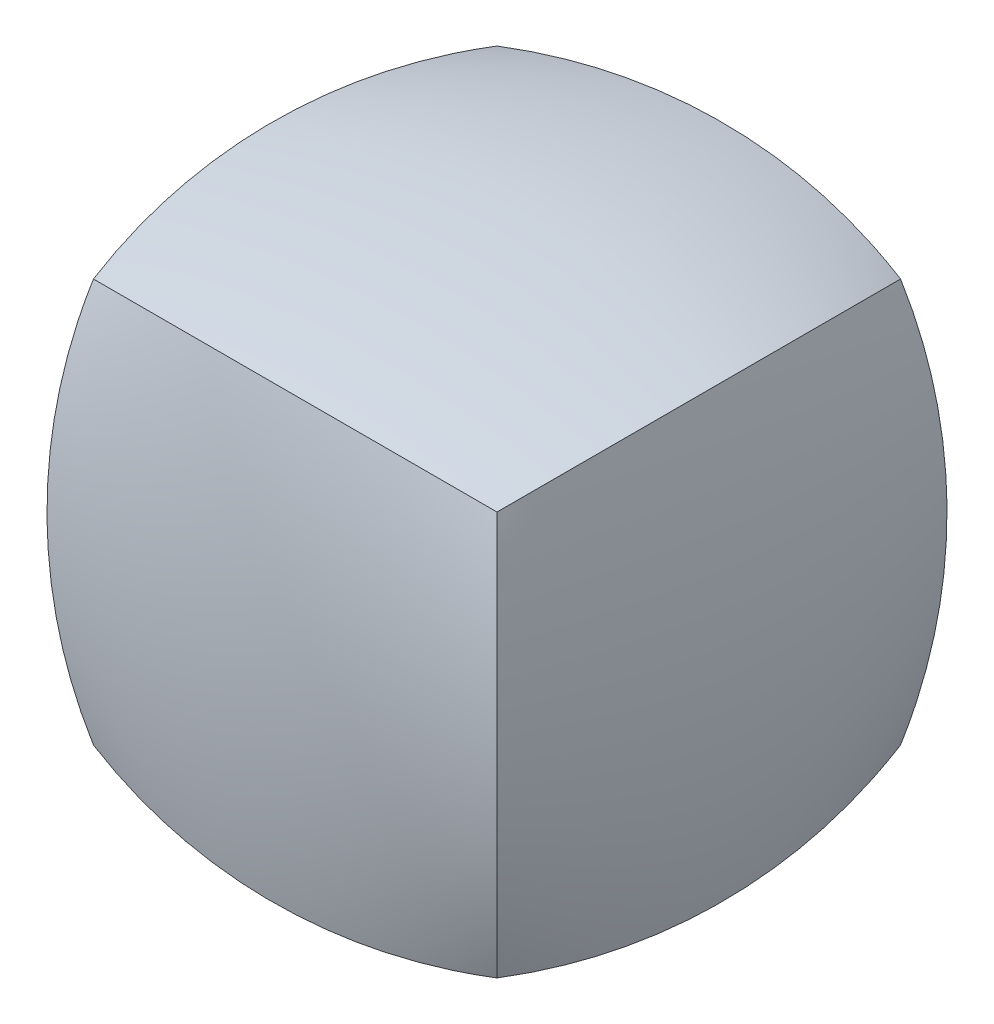
ISO-10303-21;
HEADER;
FILE_DESCRIPTION(('STEP AP214'),'2;1');
FILE_NAME('part.step','',(''),(''),'','','');
FILE_SCHEMA(('AUTOMOTIVE_DESIGN { 1 0 10303 214 1 1 1 1 }'));
ENDSEC;
DATA;
#1=APPLICATION_CONTEXT('core data for automotive mechanical design processes');
#2=APPLICATION_PROTOCOL_DEFINITION('international standard','automotive_design',2000,#1);
#3=PRODUCT_CONTEXT('',#1,'mechanical');
#4=PRODUCT('Part','Part','',(#3));
#5=PRODUCT_RELATED_PRODUCT_CATEGORY('part','',(#4));
#6=PRODUCT_DEFINITION_FORMATION('','',#4);
#7=PRODUCT_DEFINITION_CONTEXT('part definition',#1,'design');
#8=PRODUCT_DEFINITION('design','',#6,#7);
#9=PRODUCT_DEFINITION_SHAPE('','',#8);
#10=(LENGTH_UNIT() NAMED_UNIT(*) SI_UNIT(.MILLI.,.METRE.));
#11=(NAMED_UNIT(*) PLANE_ANGLE_UNIT() SI_UNIT($,.RADIAN.));
#12=(NAMED_UNIT(*) SI_UNIT($,.STERADIAN.) SOLID_ANGLE_UNIT());
#13=UNCERTAINTY_MEASURE_WITH_UNIT(LENGTH_MEASURE(1.E-05),#10,'distance_accuracy_value','');
#14=(GEOMETRIC_REPRESENTATION_CONTEXT(3) GLOBAL_UNCERTAINTY_ASSIGNED_CONTEXT((#13)) GLOBAL_UNIT_ASSIGNED_CONTEXT((#10,
#11,#12)) REPRESENTATION_CONTEXT('',''));
#15=CARTESIAN_POINT('',(0.,0.,0.));
#16=DIRECTION('',(0.,0.,1.));
#17=DIRECTION('',(1.,0.,0.));
#18=AXIS2_PLACEMENT_3D('',#15,#16,#17);
#19=CARTESIAN_POINT('',(-12.7,-12.7,12.7));
#20=CARTESIAN_POINT('',(-13.183216377052,-13.1832163770521,10.6573922002457));
#21=CARTESIAN_POINT('',(-13.9160332738068,-13.9160332738068,6.46166299538645));
#22=CARTESIAN_POINT('',(-14.2855769974257,-14.2855769974258,0.));
#23=CARTESIAN_POINT('',(-13.9160332738068,-13.9160332738068,-6.46166299538644));
#24=CARTESIAN_POINT('',(-13.183216377052,-13.1832163770521,-10.6573922002457));
#25=CARTESIAN_POINT('',(-12.7,-12.7,-12.7));
#26=CARTESIAN_POINT('',(-13.183216377052,-10.6573922002457,13.1832163770521));
#27=CARTESIAN_POINT('',(-13.6664327541041,-11.0520189081716,11.0520189081716));
#28=CARTESIAN_POINT('',(-14.3992496508588,-11.6504860405213,6.69119077448619));
#29=CARTESIAN_POINT('',(-14.7687933744778,-11.9522800814768,0.));
#30=CARTESIAN_POINT('',(-14.3992496508588,-11.6504860405213,-6.69119077448617));
#31=CARTESIAN_POINT('',(-13.6664327541041,-11.0520189081716,-11.0520189081716));
#32=CARTESIAN_POINT('',(-13.183216377052,-10.6573922002458,-13.1832163770521));
#33=CARTESIAN_POINT('',(-13.9160332738068,-6.46166299538648,13.9160332738068));
#34=CARTESIAN_POINT('',(-14.3992496508588,-6.69119077448622,11.6504860405213));
#35=CARTESIAN_POINT('',(-15.1320665476136,-7.03927880044471,7.03927880044468));
#36=CARTESIAN_POINT('',(-15.5016102712325,-7.21481206916371,0.));
#37=CARTESIAN_POINT('',(-15.1320665476136,-7.03927880044471,-7.03927880044467));
#38=CARTESIAN_POINT('',(-14.3992496508588,-6.69119077448622,-11.6504860405213));
#39=CARTESIAN_POINT('',(-13.9160332738068,-6.46166299538648,-13.9160332738068));
#40=CARTESIAN_POINT('',(-14.2855769974257,0.,14.2855769974258));
#41=CARTESIAN_POINT('',(-14.7687933744778,0.,11.9522800814768));
#42=CARTESIAN_POINT('',(-15.5016102712325,0.,7.21481206916369));
#43=CARTESIAN_POINT('',(-15.8711539948515,0.,0.));
#44=CARTESIAN_POINT('',(-15.5016102712325,0.,-7.21481206916368));
#45=CARTESIAN_POINT('',(-14.7687933744778,0.,-11.9522800814768));
#46=CARTESIAN_POINT('',(-14.2855769974258,0.,-14.2855769974258));
#47=CARTESIAN_POINT('',(-13.9160332738068,6.46166299538643,13.9160332738068));
#48=CARTESIAN_POINT('',(-14.3992496508589,6.69119077448615,11.6504860405213));
#49=CARTESIAN_POINT('',(-15.1320665476136,7.03927880044464,7.03927880044467));
#50=CARTESIAN_POINT('',(-15.5016102712325,7.21481206916367,0.));
#51=CARTESIAN_POINT('',(-15.1320665476136,7.03927880044462,-7.03927880044468));
#52=CARTESIAN_POINT('',(-14.3992496508589,6.69119077448615,-11.6504860405213));
#53=CARTESIAN_POINT('',(-13.9160332738068,6.46166299538642,-13.9160332738068));
#54=CARTESIAN_POINT('',(-13.1832163770521,10.6573922002457,13.1832163770521));
#55=CARTESIAN_POINT('',(-13.6664327541042,11.0520189081716,11.0520189081716));
#56=CARTESIAN_POINT('',(-14.3992496508589,11.6504860405212,6.69119077448619));
#57=CARTESIAN_POINT('',(-14.7687933744778,11.9522800814768,0.));
#58=CARTESIAN_POINT('',(-14.3992496508589,11.6504860405212,-6.69119077448619));
#59=CARTESIAN_POINT('',(-13.6664327541042,11.0520189081716,-11.0520189081716));
#60=CARTESIAN_POINT('',(-13.1832163770521,10.6573922002457,-13.1832163770521));
#61=CARTESIAN_POINT('',(-12.7,12.7,12.7));
#62=CARTESIAN_POINT('',(-13.1832163770521,13.183216377052,10.6573922002457));
#63=CARTESIAN_POINT('',(-13.9160332738068,13.9160332738068,6.46166299538645));
#64=CARTESIAN_POINT('',(-14.2855769974258,14.2855769974257,0.));
#65=CARTESIAN_POINT('',(-13.9160332738068,13.9160332738067,-6.46166299538645));
#66=CARTESIAN_POINT('',(-13.1832163770521,13.183216377052,-10.6573922002457));
#67=CARTESIAN_POINT('',(-12.7,12.7,-12.7));
#68=B_SPLINE_SURFACE_WITH_KNOTS('',3,3,((#19,#20,#21,#22,#23,#24,#25),(#26,#27,#28,#29,#30,#31,
#32),(#33,#34,#35,#36,#37,#38,#39),(#40,#41,#42,#43,#44,#45,#46),(#47,#48,#49,#50,#51,#52,#53),
(#54,#55,#56,#57,#58,#59,#60),(#61,#62,#63,#64,#65,#66,#67)),.UNSPECIFIED.,.F.,.F.,.F.,(4,1,1,1,
4),(4,1,1,1,4),(0.,0.25,0.5,0.75,1.),(0.,0.25,0.5,0.75,1.),.UNSPECIFIED.);
#69=CARTESIAN_POINT('',(-12.7,-12.7,12.7));
#70=CARTESIAN_POINT('',(-13.183216377052,-10.6573922002457,13.1832163770521));
#71=CARTESIAN_POINT('',(-13.9160332738068,-6.46166299538648,13.9160332738068));
#72=CARTESIAN_POINT('',(-14.2855769974257,0.,14.2855769974258));
#73=CARTESIAN_POINT('',(-13.9160332738068,6.46166299538643,13.9160332738068));
#74=CARTESIAN_POINT('',(-13.1832163770521,10.6573922002457,13.1832163770521));
#75=CARTESIAN_POINT('',(-12.7,12.7,12.7));
#76=B_SPLINE_CURVE_WITH_KNOTS('',3,(#69,#70,#71,#72,#73,#74,#75),.UNSPECIFIED.,.F.,.F.,(4,1,1,1,
4),(0.,0.25,0.5,0.75,1.),.UNSPECIFIED.);
#77=CARTESIAN_POINT('',(-12.7,-12.7,12.7));
#78=VERTEX_POINT('',#77);
#79=CARTESIAN_POINT('',(-12.7,12.7,12.7));
#80=VERTEX_POINT('',#79);
#81=EDGE_CURVE('E195',#78,#80,#76,.T.);
#82=CARTESIAN_POINT('',(-12.7,12.7,12.7));
#83=CARTESIAN_POINT('',(-13.1832163770521,13.183216377052,10.6573922002457));
#84=CARTESIAN_POINT('',(-13.9160332738068,13.9160332738068,6.46166299538645));
#85=CARTESIAN_POINT('',(-14.2855769974258,14.2855769974257,0.));
#86=CARTESIAN_POINT('',(-13.9160332738068,13.9160332738067,-6.46166299538645));
#87=CARTESIAN_POINT('',(-13.1832163770521,13.183216377052,-10.6573922002457));
#88=CARTESIAN_POINT('',(-12.7,12.7,-12.7));
#89=B_SPLINE_CURVE_WITH_KNOTS('',3,(#82,#83,#84,#85,#86,#87,#88),.UNSPECIFIED.,.F.,.F.,(4,1,1,1,
4),(0.,0.25,0.5,0.75,1.),.UNSPECIFIED.);
#90=CARTESIAN_POINT('',(-12.7,12.7,-12.7));
#91=VERTEX_POINT('',#90);
#92=EDGE_CURVE('E293',#80,#91,#89,.T.);
#93=CARTESIAN_POINT('',(-12.7,-12.7,-12.7));
#94=CARTESIAN_POINT('',(-13.183216377052,-10.6573922002458,-13.1832163770521));
#95=CARTESIAN_POINT('',(-13.9160332738068,-6.46166299538648,-13.9160332738068));
#96=CARTESIAN_POINT('',(-14.2855769974258,0.,-14.2855769974258));
#97=CARTESIAN_POINT('',(-13.9160332738068,6.46166299538642,-13.9160332738068));
#98=CARTESIAN_POINT('',(-13.1832163770521,10.6573922002457,-13.1832163770521));
#99=CARTESIAN_POINT('',(-12.7,12.7,-12.7));
#100=B_SPLINE_CURVE_WITH_KNOTS('',3,(#93,#94,#95,#96,#97,#98,#99),.UNSPECIFIED.,.F.,.F.,(4,1,1,
1,4),(0.,0.25,0.5,0.75,1.),.UNSPECIFIED.);
#101=CARTESIAN_POINT('',(-12.7,-12.7,-12.7));
#102=VERTEX_POINT('',#101);
#103=EDGE_CURVE('E243',#91,#102,#100,.F.);
#104=CARTESIAN_POINT('',(-12.7,-12.7,12.7));
#105=CARTESIAN_POINT('',(-13.183216377052,-13.1832163770521,10.6573922002457));
#106=CARTESIAN_POINT('',(-13.9160332738068,-13.9160332738068,6.46166299538645));
#107=CARTESIAN_POINT('',(-14.2855769974257,-14.2855769974258,0.));
#108=CARTESIAN_POINT('',(-13.9160332738068,-13.9160332738068,-6.46166299538644));
#109=CARTESIAN_POINT('',(-13.183216377052,-13.1832163770521,-10.6573922002457));
#110=CARTESIAN_POINT('',(-12.7,-12.7,-12.7));
#111=B_SPLINE_CURVE_WITH_KNOTS('',3,(#104,#105,#106,#107,#108,#109,#110),.UNSPECIFIED.,.F.,.F.,
(4,1,1,1,4),(0.,0.25,0.5,0.75,1.),.UNSPECIFIED.);
#112=EDGE_CURVE('E242',#102,#78,#111,.F.);
#113=ORIENTED_EDGE('',*,*,#81,.T.);
#114=ORIENTED_EDGE('',*,*,#92,.T.);
#115=ORIENTED_EDGE('',*,*,#103,.T.);
#116=ORIENTED_EDGE('',*,*,#112,.T.);
#117=EDGE_LOOP('',(#113,#114,#115,#116));
#118=FACE_BOUND('',#117,.T.);
#119=ADVANCED_FACE('F190',(#118),#68,.T.);
#120=CARTESIAN_POINT('',(-12.7,-12.6999999999999,12.7000000000001));
#121=CARTESIAN_POINT('',(-13.183216377052,-10.6573922002456,13.1832163770522));
#122=CARTESIAN_POINT('',(-13.9160332738068,-6.46166299538631,13.9160332738069));
#123=CARTESIAN_POINT('',(-14.2855769974257,1.36623137101251E-13,14.2855769974257));
#124=CARTESIAN_POINT('',(-13.9160332738068,6.46166299538659,13.9160332738067));
#125=CARTESIAN_POINT('',(-13.1832163770521,10.6573922002459,13.183216377052));
#126=CARTESIAN_POINT('',(-12.7,12.7000000000001,12.6999999999999));
#127=CARTESIAN_POINT('',(-10.6573922002457,-13.1832163770519,13.1832163770522));
#128=CARTESIAN_POINT('',(-11.0520189081716,-11.0520189081714,13.6664327541043));
#129=CARTESIAN_POINT('',(-11.6504860405212,-6.69119077448604,14.3992496508589));
#130=CARTESIAN_POINT('',(-11.9522800814767,1.4309402574636E-13,14.7687933744778));
#131=CARTESIAN_POINT('',(-11.6504860405212,6.69119077448633,14.3992496508588));
#132=CARTESIAN_POINT('',(-11.0520189081716,11.0520189081717,13.666432754104));
#133=CARTESIAN_POINT('',(-10.6573922002457,13.1832163770522,13.1832163770519));
#134=CARTESIAN_POINT('',(-6.46166299538643,-13.9160332738067,13.9160332738069));
#135=CARTESIAN_POINT('',(-6.69119077448617,-11.6504860405211,14.399249650859));
#136=CARTESIAN_POINT('',(-7.03927880044465,-7.03927880044452,15.1320665476137));
#137=CARTESIAN_POINT('',(-7.21481206916365,1.54564587355336E-13,15.5016102712325));
#138=CARTESIAN_POINT('',(-7.03927880044465,7.03927880044483,15.1320665476135));
#139=CARTESIAN_POINT('',(-6.69119077448617,11.6504860405214,14.3992496508587));
#140=CARTESIAN_POINT('',(-6.46166299538644,13.9160332738069,13.9160332738066));
#141=CARTESIAN_POINT('',(0.,-14.2855769974256,14.2855769974259));
#142=CARTESIAN_POINT('',(0.,-11.9522800814766,14.7687933744779));
#143=CARTESIAN_POINT('',(0.,-7.21481206916353,15.5016102712326));
#144=CARTESIAN_POINT('',(0.,1.56266950297019E-13,15.8711539948515));
#145=CARTESIAN_POINT('',(0.,7.21481206916384,15.5016102712325));
#146=CARTESIAN_POINT('',(0.,11.9522800814769,14.7687933744777));
#147=CARTESIAN_POINT('',(0.,14.2855769974259,14.2855769974256));
#148=CARTESIAN_POINT('',(6.46166299538647,-13.9160332738066,13.9160332738069));
#149=CARTESIAN_POINT('',(6.6911907744862,-11.6504860405211,14.399249650859));
#150=CARTESIAN_POINT('',(7.0392788004447,-7.03927880044451,15.1320665476136));
#151=CARTESIAN_POINT('',(7.21481206916372,1.61503481259243E-13,15.5016102712325));
#152=CARTESIAN_POINT('',(7.03927880044468,7.03927880044483,15.1320665476135));
#153=CARTESIAN_POINT('',(6.6911907744862,11.6504860405214,14.3992496508587));
#154=CARTESIAN_POINT('',(6.46166299538647,13.9160332738069,13.9160332738066));
#155=CARTESIAN_POINT('',(10.6573922002458,-13.1832163770519,13.1832163770522));
#156=CARTESIAN_POINT('',(11.0520189081716,-11.0520189081714,13.6664327541042));
#157=CARTESIAN_POINT('',(11.6504860405213,-6.69119077448604,14.3992496508589));
#158=CARTESIAN_POINT('',(11.9522800814768,1.48623456826036E-13,14.7687933744778));
#159=CARTESIAN_POINT('',(11.6504860405213,6.69119077448634,14.3992496508588));
#160=CARTESIAN_POINT('',(11.0520189081716,11.0520189081717,13.666432754104));
#161=CARTESIAN_POINT('',(10.6573922002458,13.1832163770522,13.1832163770519));
#162=CARTESIAN_POINT('',(12.7,-12.6999999999999,12.7000000000001));
#163=CARTESIAN_POINT('',(13.1832163770521,-10.6573922002456,13.1832163770522));
#164=CARTESIAN_POINT('',(13.9160332738068,-6.46166299538631,13.9160332738068));
#165=CARTESIAN_POINT('',(14.2855769974258,1.46164116219123E-13,14.2855769974257));
#166=CARTESIAN_POINT('',(13.9160332738068,6.4616629953866,13.9160332738067));
#167=CARTESIAN_POINT('',(13.1832163770521,10.6573922002459,13.1832163770519));
#168=CARTESIAN_POINT('',(12.7,12.7000000000001,12.6999999999998));
#169=B_SPLINE_SURFACE_WITH_KNOTS('',3,3,((#120,#121,#122,#123,#124,#125,#126),(#127,#128,#129,
#130,#131,#132,#133),(#134,#135,#136,#137,#138,#139,#140),(#141,#142,#143,#144,#145,#146,#147),
(#148,#149,#150,#151,#152,#153,#154),(#155,#156,#157,#158,#159,#160,#161),(#162,#163,#164,#165,
#166,#167,#168)),.UNSPECIFIED.,.F.,.F.,.F.,(4,1,1,1,4),(4,1,1,1,4),(0.,0.25,0.5,0.75,1.),(0.,
0.25,0.5,0.75,1.),.UNSPECIFIED.);
#170=CARTESIAN_POINT('',(-12.7,-12.6999999999999,12.7000000000001));
#171=CARTESIAN_POINT('',(-10.6573922002457,-13.1832163770519,13.1832163770522));
#172=CARTESIAN_POINT('',(-6.46166299538643,-13.9160332738067,13.9160332738069));
#173=CARTESIAN_POINT('',(0.,-14.2855769974256,14.2855769974259));
#174=CARTESIAN_POINT('',(6.46166299538647,-13.9160332738066,13.9160332738069));
#175=CARTESIAN_POINT('',(10.6573922002458,-13.1832163770519,13.1832163770522));
#176=CARTESIAN_POINT('',(12.7,-12.6999999999999,12.7000000000001));
#177=B_SPLINE_CURVE_WITH_KNOTS('',3,(#170,#171,#172,#173,#174,#175,#176),.UNSPECIFIED.,.F.,.F.,
(4,1,1,1,4),(0.,0.25,0.5,0.75,1.),.UNSPECIFIED.);
#178=CARTESIAN_POINT('',(12.7000000000001,-12.6999999999999,12.7000000000001));
#179=VERTEX_POINT('',#178);
#180=EDGE_CURVE('E234',#78,#179,#177,.T.);
#181=CARTESIAN_POINT('',(12.6999999999999,12.7000000000001,12.7));
#182=CARTESIAN_POINT('',(13.183216377052,10.6573922002458,13.1832163770521));
#183=CARTESIAN_POINT('',(13.9160332738067,6.46166299538657,13.9160332738068));
#184=CARTESIAN_POINT('',(14.2855769974257,1.30551604935332E-13,14.2855769974258));
#185=CARTESIAN_POINT('',(13.9160332738068,-6.46166299538633,13.9160332738068));
#186=CARTESIAN_POINT('',(13.1832163770522,-10.6573922002456,13.1832163770521));
#187=CARTESIAN_POINT('',(12.7000000000001,-12.6999999999999,12.7));
#188=B_SPLINE_CURVE_WITH_KNOTS('',3,(#181,#182,#183,#184,#185,#186,#187),.UNSPECIFIED.,.F.,.F.,
(4,1,1,1,4),(0.,0.25,0.5,0.75,1.),.UNSPECIFIED.);
#189=CARTESIAN_POINT('',(12.6999999999999,12.7,12.7));
#190=VERTEX_POINT('',#189);
#191=EDGE_CURVE('E213',#190,#179,#188,.T.);
#192=CARTESIAN_POINT('',(-12.7,12.7,12.7));
#193=CARTESIAN_POINT('',(-10.6573922002457,13.1832163770521,13.1832163770521));
#194=CARTESIAN_POINT('',(-6.46166299538643,13.9160332738068,13.9160332738068));
#195=CARTESIAN_POINT('',(0.,14.2855769974257,14.2855769974258));
#196=CARTESIAN_POINT('',(6.46166299538647,13.9160332738068,13.9160332738068));
#197=CARTESIAN_POINT('',(10.6573922002458,13.1832163770521,13.1832163770521));
#198=CARTESIAN_POINT('',(12.7,12.7,12.7));
#199=B_SPLINE_CURVE_WITH_KNOTS('',3,(#192,#193,#194,#195,#196,#197,#198),.UNSPECIFIED.,.F.,.F.,
(4,1,1,1,4),(0.,0.25,0.5,0.75,1.),.UNSPECIFIED.);
#200=EDGE_CURVE('E236',#80,#190,#199,.T.);
#201=ORIENTED_EDGE('',*,*,#180,.T.);
#202=ORIENTED_EDGE('',*,*,#191,.F.);
#203=ORIENTED_EDGE('',*,*,#200,.F.);
#204=ORIENTED_EDGE('',*,*,#81,.F.);
#205=EDGE_LOOP('',(#201,#202,#203,#204));
#206=FACE_BOUND('',#205,.T.);
#207=ADVANCED_FACE('F232',(#206),#169,.T.);
#208=CARTESIAN_POINT('',(-12.7,-12.7000000000001,-12.6999999999999));
#209=CARTESIAN_POINT('',(-13.183216377052,-13.1832163770521,-10.6573922002456));
#210=CARTESIAN_POINT('',(-13.9160332738068,-13.9160332738069,-6.46166299538636));
#211=CARTESIAN_POINT('',(-14.2855769974257,-14.2855769974257,0.));
#212=CARTESIAN_POINT('',(-13.9160332738068,-13.9160332738068,6.46166299538654));
#213=CARTESIAN_POINT('',(-13.1832163770521,-13.183216377052,10.6573922002458));
#214=CARTESIAN_POINT('',(-12.7,-12.6999999999999,12.7000000000001));
#215=CARTESIAN_POINT('',(-10.6573922002457,-13.1832163770522,-13.183216377052));
#216=CARTESIAN_POINT('',(-11.0520189081716,-13.6664327541042,-11.0520189081715));
#217=CARTESIAN_POINT('',(-11.6504860405212,-14.3992496508589,-6.69119077448609));
#218=CARTESIAN_POINT('',(-11.9522800814767,-14.7687933744778,0.));
#219=CARTESIAN_POINT('',(-11.6504860405212,-14.3992496508588,6.69119077448627));
#220=CARTESIAN_POINT('',(-11.0520189081716,-13.6664327541041,11.0520189081717));
#221=CARTESIAN_POINT('',(-10.6573922002457,-13.183216377052,13.1832163770522));
#222=CARTESIAN_POINT('',(-6.46166299538643,-13.9160332738069,-13.9160332738067));
#223=CARTESIAN_POINT('',(-6.69119077448617,-14.3992496508589,-11.6504860405212));
#224=CARTESIAN_POINT('',(-7.03927880044465,-15.1320665476136,-7.03927880044457));
#225=CARTESIAN_POINT('',(-7.21481206916365,-15.5016102712325,1.00440973022926E-13));
#226=CARTESIAN_POINT('',(-7.03927880044465,-15.1320665476135,7.03927880044478));
#227=CARTESIAN_POINT('',(-6.69119077448617,-14.3992496508588,11.6504860405214));
#228=CARTESIAN_POINT('',(-6.46166299538644,-13.9160332738067,13.9160332738069));
#229=CARTESIAN_POINT('',(0.,-14.2855769974258,-14.2855769974257));
#230=CARTESIAN_POINT('',(0.,-14.7687933744779,-11.9522800814767));
#231=CARTESIAN_POINT('',(0.,-15.5016102712326,-7.21481206916358));
#232=CARTESIAN_POINT('',(0.,-15.8711539948515,1.00853080202391E-13));
#233=CARTESIAN_POINT('',(0.,-15.5016102712325,7.21481206916379));
#234=CARTESIAN_POINT('',(0.,-14.7687933744777,11.9522800814769));
#235=CARTESIAN_POINT('',(0.,-14.2855769974257,14.2855769974259));
#236=CARTESIAN_POINT('',(6.46166299538647,-13.9160332738069,-13.9160332738067));
#237=CARTESIAN_POINT('',(6.6911907744862,-14.3992496508589,-11.6504860405212));
#238=CARTESIAN_POINT('',(7.0392788004447,-15.1320665476136,-7.03927880044456));
#239=CARTESIAN_POINT('',(7.21481206916372,-15.5016102712325,1.07379866926833E-13));
#240=CARTESIAN_POINT('',(7.03927880044468,-15.1320665476135,7.03927880044478));
#241=CARTESIAN_POINT('',(6.6911907744862,-14.3992496508588,11.6504860405214));
#242=CARTESIAN_POINT('',(6.46166299538647,-13.9160332738067,13.9160332738069));
#243=CARTESIAN_POINT('',(10.6573922002458,-13.1832163770521,-13.183216377052));
#244=CARTESIAN_POINT('',(11.0520189081716,-13.6664327541042,-11.0520189081715));
#245=CARTESIAN_POINT('',(11.6504860405213,-14.3992496508589,-6.69119077448609));
#246=CARTESIAN_POINT('',(11.9522800814768,-14.7687933744778,0.));
#247=CARTESIAN_POINT('',(11.6504860405213,-14.3992496508588,6.69119077448629));
#248=CARTESIAN_POINT('',(11.0520189081716,-13.666432754104,11.0520189081717));
#249=CARTESIAN_POINT('',(10.6573922002458,-13.183216377052,13.1832163770522));
#250=CARTESIAN_POINT('',(12.7,-12.7000000000001,-12.6999999999999));
#251=CARTESIAN_POINT('',(13.1832163770521,-13.1832163770521,-10.6573922002456));
#252=CARTESIAN_POINT('',(13.9160332738068,-13.9160332738068,-6.46166299538636));
#253=CARTESIAN_POINT('',(14.2855769974258,-14.2855769974257,0.));
#254=CARTESIAN_POINT('',(13.9160332738068,-13.9160332738067,6.46166299538655));
#255=CARTESIAN_POINT('',(13.1832163770521,-13.183216377052,10.6573922002458));
#256=CARTESIAN_POINT('',(12.7,-12.6999999999999,12.7000000000001));
#257=B_SPLINE_SURFACE_WITH_KNOTS('',3,3,((#208,#209,#210,#211,#212,#213,#214),(#215,#216,#217,
#218,#219,#220,#221),(#222,#223,#224,#225,#226,#227,#228),(#229,#230,#231,#232,#233,#234,#235),
(#236,#237,#238,#239,#240,#241,#242),(#243,#244,#245,#246,#247,#248,#249),(#250,#251,#252,#253,
#254,#255,#256)),.UNSPECIFIED.,.F.,.F.,.F.,(4,1,1,1,4),(4,1,1,1,4),(0.,0.25,0.5,0.75,1.),(0.,
0.25,0.5,0.75,1.),.UNSPECIFIED.);
#258=CARTESIAN_POINT('',(-12.7,-12.7000000000001,-12.6999999999999));
#259=CARTESIAN_POINT('',(-10.6573922002457,-13.1832163770522,-13.183216377052));
#260=CARTESIAN_POINT('',(-6.46166299538643,-13.9160332738069,-13.9160332738067));
#261=CARTESIAN_POINT('',(0.,-14.2855769974258,-14.2855769974257));
#262=CARTESIAN_POINT('',(6.46166299538647,-13.9160332738069,-13.9160332738067));
#263=CARTESIAN_POINT('',(10.6573922002458,-13.1832163770521,-13.183216377052));
#264=CARTESIAN_POINT('',(12.7,-12.7000000000001,-12.6999999999999));
#265=B_SPLINE_CURVE_WITH_KNOTS('',3,(#258,#259,#260,#261,#262,#263,#264),.UNSPECIFIED.,.F.,.F.,
(4,1,1,1,4),(0.,0.25,0.5,0.75,1.),.UNSPECIFIED.);
#266=CARTESIAN_POINT('',(12.7,-12.7000000000001,-12.6999999999999));
#267=VERTEX_POINT('',#266);
#268=EDGE_CURVE('E247',#102,#267,#265,.T.);
#269=CARTESIAN_POINT('',(12.7000000000001,-12.6999999999999,12.7));
#270=CARTESIAN_POINT('',(13.1832163770522,-13.183216377052,10.6573922002457));
#271=CARTESIAN_POINT('',(13.9160332738069,-13.9160332738067,6.46166299538645));
#272=CARTESIAN_POINT('',(14.2855769974259,-14.2855769974257,0.));
#273=CARTESIAN_POINT('',(13.9160332738069,-13.9160332738066,-6.46166299538645));
#274=CARTESIAN_POINT('',(13.1832163770522,-13.183216377052,-10.6573922002457));
#275=CARTESIAN_POINT('',(12.7000000000001,-12.6999999999999,-12.7));
#276=B_SPLINE_CURVE_WITH_KNOTS('',3,(#269,#270,#271,#272,#273,#274,#275),.UNSPECIFIED.,.F.,.F.,
(4,1,1,1,4),(0.,0.25,0.5,0.75,1.),.UNSPECIFIED.);
#277=EDGE_CURVE('E251',#179,#267,#276,.T.);
#278=ORIENTED_EDGE('',*,*,#268,.T.);
#279=ORIENTED_EDGE('',*,*,#277,.F.);
#280=ORIENTED_EDGE('',*,*,#180,.F.);
#281=ORIENTED_EDGE('',*,*,#112,.F.);
#282=EDGE_LOOP('',(#278,#279,#280,#281));
#283=FACE_BOUND('',#282,.T.);
#284=ADVANCED_FACE('F249',(#283),#257,.T.);
#285=CARTESIAN_POINT('',(-12.7,12.7,-12.7));
#286=CARTESIAN_POINT('',(-13.183216377052,10.6573922002457,-13.1832163770521));
#287=CARTESIAN_POINT('',(-13.9160332738068,6.4616629953864,-13.9160332738068));
#288=CARTESIAN_POINT('',(-14.2855769974257,0.,-14.2855769974257));
#289=CARTESIAN_POINT('',(-13.9160332738068,-6.46166299538649,-13.9160332738068));
#290=CARTESIAN_POINT('',(-13.1832163770521,-10.6573922002458,-13.183216377052));
#291=CARTESIAN_POINT('',(-12.7,-12.7,-12.7));
#292=CARTESIAN_POINT('',(-10.6573922002457,13.183216377052,-13.1832163770521));
#293=CARTESIAN_POINT('',(-11.0520189081716,11.0520189081715,-13.6664327541042));
#294=CARTESIAN_POINT('',(-11.6504860405212,6.69119077448614,-14.3992496508589));
#295=CARTESIAN_POINT('',(-11.9522800814767,0.,-14.7687933744778));
#296=CARTESIAN_POINT('',(-11.6504860405212,-6.69119077448623,-14.3992496508588));
#297=CARTESIAN_POINT('',(-11.0520189081716,-11.0520189081716,-13.6664327541041));
#298=CARTESIAN_POINT('',(-10.6573922002457,-13.1832163770521,-13.183216377052));
#299=CARTESIAN_POINT('',(-6.46166299538643,13.9160332738068,-13.9160332738068));
#300=CARTESIAN_POINT('',(-6.69119077448617,11.6504860405212,-14.3992496508589));
#301=CARTESIAN_POINT('',(-7.03927880044465,7.03927880044462,-15.1320665476136));
#302=CARTESIAN_POINT('',(-7.21481206916365,0.,-15.5016102712325));
#303=CARTESIAN_POINT('',(-7.03927880044465,-7.03927880044472,-15.1320665476136));
#304=CARTESIAN_POINT('',(-6.69119077448617,-11.6504860405213,-14.3992496508588));
#305=CARTESIAN_POINT('',(-6.46166299538644,-13.9160332738068,-13.9160332738067));
#306=CARTESIAN_POINT('',(0.,14.2855769974257,-14.2855769974258));
#307=CARTESIAN_POINT('',(0.,11.9522800814767,-14.7687933744778));
#308=CARTESIAN_POINT('',(0.,7.21481206916363,-15.5016102712326));
#309=CARTESIAN_POINT('',(0.,0.,-15.8711539948515));
#310=CARTESIAN_POINT('',(0.,-7.21481206916373,-15.5016102712325));
#311=CARTESIAN_POINT('',(0.,-11.9522800814768,-14.7687933744778));
#312=CARTESIAN_POINT('',(0.,-14.2855769974258,-14.2855769974257));
#313=CARTESIAN_POINT('',(6.46166299538647,13.9160332738067,-13.9160332738068));
#314=CARTESIAN_POINT('',(6.6911907744862,11.6504860405212,-14.3992496508589));
#315=CARTESIAN_POINT('',(7.0392788004447,7.03927880044462,-15.1320665476136));
#316=CARTESIAN_POINT('',(7.21481206916372,0.,-15.5016102712325));
#317=CARTESIAN_POINT('',(7.03927880044468,-7.03927880044473,-15.1320665476135));
#318=CARTESIAN_POINT('',(6.6911907744862,-11.6504860405213,-14.3992496508588));
#319=CARTESIAN_POINT('',(6.46166299538647,-13.9160332738068,-13.9160332738067));
#320=CARTESIAN_POINT('',(10.6573922002458,13.183216377052,-13.1832163770521));
#321=CARTESIAN_POINT('',(11.0520189081716,11.0520189081715,-13.6664327541042));
#322=CARTESIAN_POINT('',(11.6504860405213,6.69119077448614,-14.3992496508589));
#323=CARTESIAN_POINT('',(11.9522800814768,0.,-14.7687933744778));
#324=CARTESIAN_POINT('',(11.6504860405213,-6.69119077448623,-14.3992496508588));
#325=CARTESIAN_POINT('',(11.0520189081716,-11.0520189081716,-13.6664327541041));
#326=CARTESIAN_POINT('',(10.6573922002458,-13.1832163770521,-13.183216377052));
#327=CARTESIAN_POINT('',(12.7,12.7,-12.7));
#328=CARTESIAN_POINT('',(13.1832163770521,10.6573922002457,-13.1832163770521));
#329=CARTESIAN_POINT('',(13.9160332738068,6.4616629953864,-13.9160332738068));
#330=CARTESIAN_POINT('',(14.2855769974258,0.,-14.2855769974257));
#331=CARTESIAN_POINT('',(13.9160332738068,-6.4616629953865,-13.9160332738067));
#332=CARTESIAN_POINT('',(13.1832163770521,-10.6573922002458,-13.183216377052));
#333=CARTESIAN_POINT('',(12.7,-12.7000000000001,-12.6999999999999));
#334=B_SPLINE_SURFACE_WITH_KNOTS('',3,3,((#285,#286,#287,#288,#289,#290,#291),(#292,#293,#294,
#295,#296,#297,#298),(#299,#300,#301,#302,#303,#304,#305),(#306,#307,#308,#309,#310,#311,#312),
(#313,#314,#315,#316,#317,#318,#319),(#320,#321,#322,#323,#324,#325,#326),(#327,#328,#329,#330,
#331,#332,#333)),.UNSPECIFIED.,.F.,.F.,.F.,(4,1,1,1,4),(4,1,1,1,4),(0.,0.25,0.5,0.75,1.),(0.,
0.25,0.5,0.75,1.),.UNSPECIFIED.);
#335=CARTESIAN_POINT('',(-12.7,12.7,-12.7));
#336=CARTESIAN_POINT('',(-10.6573922002457,13.183216377052,-13.1832163770521));
#337=CARTESIAN_POINT('',(-6.46166299538643,13.9160332738068,-13.9160332738068));
#338=CARTESIAN_POINT('',(0.,14.2855769974257,-14.2855769974258));
#339=CARTESIAN_POINT('',(6.46166299538647,13.9160332738067,-13.9160332738068));
#340=CARTESIAN_POINT('',(10.6573922002458,13.183216377052,-13.1832163770521));
#341=CARTESIAN_POINT('',(12.7,12.7,-12.7));
#342=B_SPLINE_CURVE_WITH_KNOTS('',3,(#335,#336,#337,#338,#339,#340,#341),.UNSPECIFIED.,.F.,.F.,
(4,1,1,1,4),(0.,0.25,0.5,0.75,1.),.UNSPECIFIED.);
#343=CARTESIAN_POINT('',(12.7,12.7,-12.7));
#344=VERTEX_POINT('',#343);
#345=EDGE_CURVE('E285',#91,#344,#342,.T.);
#346=CARTESIAN_POINT('',(12.7,12.7,-12.7));
#347=CARTESIAN_POINT('',(13.1832163770521,10.6573922002457,-13.1832163770521));
#348=CARTESIAN_POINT('',(13.9160332738068,6.4616629953864,-13.9160332738068));
#349=CARTESIAN_POINT('',(14.2855769974258,0.,-14.2855769974257));
#350=CARTESIAN_POINT('',(13.9160332738068,-6.4616629953865,-13.9160332738067));
#351=CARTESIAN_POINT('',(13.1832163770521,-10.6573922002458,-13.183216377052));
#352=CARTESIAN_POINT('',(12.7,-12.7000000000001,-12.6999999999999));
#353=B_SPLINE_CURVE_WITH_KNOTS('',3,(#346,#347,#348,#349,#350,#351,#352),.UNSPECIFIED.,.F.,.F.,
(4,1,1,1,4),(0.,0.25,0.5,0.75,1.),.UNSPECIFIED.);
#354=EDGE_CURVE('E204',#344,#267,#353,.T.);
#355=ORIENTED_EDGE('',*,*,#345,.T.);
#356=ORIENTED_EDGE('',*,*,#354,.T.);
#357=ORIENTED_EDGE('',*,*,#268,.F.);
#358=ORIENTED_EDGE('',*,*,#103,.F.);
#359=EDGE_LOOP('',(#355,#356,#357,#358));
#360=FACE_BOUND('',#359,.T.);
#361=ADVANCED_FACE('F337',(#360),#334,.T.);
#362=CARTESIAN_POINT('',(-12.7,12.7,12.7));
#363=CARTESIAN_POINT('',(-13.183216377052,13.1832163770521,10.6573922002457));
#364=CARTESIAN_POINT('',(-13.9160332738068,13.9160332738068,6.46166299538645));
#365=CARTESIAN_POINT('',(-14.2855769974257,14.2855769974257,0.));
#366=CARTESIAN_POINT('',(-13.9160332738068,13.9160332738068,-6.46166299538644));
#367=CARTESIAN_POINT('',(-13.1832163770521,13.1832163770521,-10.6573922002457));
#368=CARTESIAN_POINT('',(-12.7,12.7,-12.7));
#369=CARTESIAN_POINT('',(-10.6573922002457,13.1832163770521,13.1832163770521));
#370=CARTESIAN_POINT('',(-11.0520189081716,13.6664327541041,11.0520189081716));
#371=CARTESIAN_POINT('',(-11.6504860405212,14.3992496508589,6.69119077448619));
#372=CARTESIAN_POINT('',(-11.9522800814767,14.7687933744778,0.));
#373=CARTESIAN_POINT('',(-11.6504860405212,14.3992496508589,-6.69119077448617));
#374=CARTESIAN_POINT('',(-11.0520189081716,13.6664327541041,-11.0520189081716));
#375=CARTESIAN_POINT('',(-10.6573922002457,13.1832163770521,-13.1832163770521));
#376=CARTESIAN_POINT('',(-6.46166299538643,13.9160332738068,13.9160332738068));
#377=CARTESIAN_POINT('',(-6.69119077448617,14.3992496508589,11.6504860405213));
#378=CARTESIAN_POINT('',(-7.03927880044465,15.1320665476136,7.03927880044468));
#379=CARTESIAN_POINT('',(-7.21481206916365,15.5016102712325,0.));
#380=CARTESIAN_POINT('',(-7.03927880044465,15.1320665476136,-7.03927880044467));
#381=CARTESIAN_POINT('',(-6.69119077448617,14.3992496508589,-11.6504860405213));
#382=CARTESIAN_POINT('',(-6.46166299538644,13.9160332738068,-13.9160332738068));
#383=CARTESIAN_POINT('',(0.,14.2855769974257,14.2855769974258));
#384=CARTESIAN_POINT('',(0.,14.7687933744778,11.9522800814768));
#385=CARTESIAN_POINT('',(0.,15.5016102712325,7.21481206916369));
#386=CARTESIAN_POINT('',(0.,15.8711539948515,0.));
#387=CARTESIAN_POINT('',(0.,15.5016102712325,-7.21481206916368));
#388=CARTESIAN_POINT('',(0.,14.7687933744778,-11.9522800814768));
#389=CARTESIAN_POINT('',(0.,14.2855769974258,-14.2855769974258));
#390=CARTESIAN_POINT('',(6.46166299538647,13.9160332738068,13.9160332738068));
#391=CARTESIAN_POINT('',(6.6911907744862,14.3992496508588,11.6504860405213));
#392=CARTESIAN_POINT('',(7.0392788004447,15.1320665476136,7.03927880044467));
#393=CARTESIAN_POINT('',(7.21481206916372,15.5016102712325,0.));
#394=CARTESIAN_POINT('',(7.03927880044468,15.1320665476135,-7.03927880044468));
#395=CARTESIAN_POINT('',(6.6911907744862,14.3992496508588,-11.6504860405213));
#396=CARTESIAN_POINT('',(6.46166299538647,13.9160332738068,-13.9160332738068));
#397=CARTESIAN_POINT('',(10.6573922002458,13.1832163770521,13.1832163770521));
#398=CARTESIAN_POINT('',(11.0520189081716,13.6664327541041,11.0520189081716));
#399=CARTESIAN_POINT('',(11.6504860405213,14.3992496508588,6.69119077448619));
#400=CARTESIAN_POINT('',(11.9522800814768,14.7687933744778,0.));
#401=CARTESIAN_POINT('',(11.6504860405213,14.3992496508588,-6.69119077448619));
#402=CARTESIAN_POINT('',(11.0520189081716,13.6664327541041,-11.0520189081716));
#403=CARTESIAN_POINT('',(10.6573922002458,13.1832163770521,-13.1832163770521));
#404=CARTESIAN_POINT('',(12.7,12.7,12.7));
#405=CARTESIAN_POINT('',(13.1832163770521,13.183216377052,10.6573922002457));
#406=CARTESIAN_POINT('',(13.9160332738068,13.9160332738068,6.46166299538645));
#407=CARTESIAN_POINT('',(14.2855769974258,14.2855769974257,0.));
#408=CARTESIAN_POINT('',(13.9160332738068,13.9160332738068,-6.46166299538645));
#409=CARTESIAN_POINT('',(13.1832163770521,13.1832163770521,-10.6573922002457));
#410=CARTESIAN_POINT('',(12.7,12.7,-12.7));
#411=B_SPLINE_SURFACE_WITH_KNOTS('',3,3,((#362,#363,#364,#365,#366,#367,#368),(#369,#370,#371,
#372,#373,#374,#375),(#376,#377,#378,#379,#380,#381,#382),(#383,#384,#385,#386,#387,#388,#389),
(#390,#391,#392,#393,#394,#395,#396),(#397,#398,#399,#400,#401,#402,#403),(#404,#405,#406,#407,
#408,#409,#410)),.UNSPECIFIED.,.F.,.F.,.F.,(4,1,1,1,4),(4,1,1,1,4),(0.,0.25,0.5,0.75,1.),(0.,
0.25,0.5,0.75,1.),.UNSPECIFIED.);
#412=CARTESIAN_POINT('',(12.7,12.7,12.7));
#413=CARTESIAN_POINT('',(13.1832163770521,13.183216377052,10.6573922002457));
#414=CARTESIAN_POINT('',(13.9160332738068,13.9160332738068,6.46166299538645));
#415=CARTESIAN_POINT('',(14.2855769974258,14.2855769974257,0.));
#416=CARTESIAN_POINT('',(13.9160332738068,13.9160332738068,-6.46166299538645));
#417=CARTESIAN_POINT('',(13.1832163770521,13.1832163770521,-10.6573922002457));
#418=CARTESIAN_POINT('',(12.7,12.7,-12.7));
#419=B_SPLINE_CURVE_WITH_KNOTS('',3,(#412,#413,#414,#415,#416,#417,#418),.UNSPECIFIED.,.F.,.F.,
(4,1,1,1,4),(0.,0.25,0.5,0.75,1.),.UNSPECIFIED.);
#420=EDGE_CURVE('E13',#190,#344,#419,.T.);
#421=ORIENTED_EDGE('',*,*,#200,.T.);
#422=ORIENTED_EDGE('',*,*,#420,.T.);
#423=ORIENTED_EDGE('',*,*,#345,.F.);
#424=ORIENTED_EDGE('',*,*,#92,.F.);
#425=EDGE_LOOP('',(#421,#422,#423,#424));
#426=FACE_BOUND('',#425,.T.);
#427=ADVANCED_FACE('F343',(#426),#411,.T.);
#428=CARTESIAN_POINT('',(12.6999999999999,12.7000000000001,12.7));
#429=CARTESIAN_POINT('',(13.1832163770519,13.1832163770522,10.6573922002457));
#430=CARTESIAN_POINT('',(13.9160332738067,13.9160332738069,6.46166299538645));
#431=CARTESIAN_POINT('',(14.2855769974256,14.2855769974259,0.));
#432=CARTESIAN_POINT('',(13.9160332738067,13.9160332738069,-6.46166299538644));
#433=CARTESIAN_POINT('',(13.1832163770519,13.1832163770522,-10.6573922002457));
#434=CARTESIAN_POINT('',(12.6999999999999,12.7000000000001,-12.7));
#435=CARTESIAN_POINT('',(13.183216377052,10.6573922002458,13.1832163770521));
#436=CARTESIAN_POINT('',(13.666432754104,11.0520189081717,11.0520189081716));
#437=CARTESIAN_POINT('',(14.3992496508588,11.6504860405214,6.69119077448619));
#438=CARTESIAN_POINT('',(14.7687933744777,11.9522800814769,0.));
#439=CARTESIAN_POINT('',(14.3992496508587,11.6504860405214,-6.69119077448617));
#440=CARTESIAN_POINT('',(13.666432754104,11.0520189081717,-11.0520189081716));
#441=CARTESIAN_POINT('',(13.183216377052,10.6573922002459,-13.1832163770521));
#442=CARTESIAN_POINT('',(13.9160332738067,6.46166299538657,13.9160332738068));
#443=CARTESIAN_POINT('',(14.3992496508588,6.69119077448632,11.6504860405213));
#444=CARTESIAN_POINT('',(15.1320665476135,7.03927880044481,7.03927880044468));
#445=CARTESIAN_POINT('',(15.5016102712325,7.21481206916382,0.));
#446=CARTESIAN_POINT('',(15.1320665476135,7.03927880044481,-7.03927880044467));
#447=CARTESIAN_POINT('',(14.3992496508588,6.69119077448632,-11.6504860405213));
#448=CARTESIAN_POINT('',(13.9160332738067,6.46166299538658,-13.9160332738068));
#449=CARTESIAN_POINT('',(14.2855769974257,1.30551604935332E-13,14.2855769974258));
#450=CARTESIAN_POINT('',(14.7687933744778,1.37673014883933E-13,11.9522800814768));
#451=CARTESIAN_POINT('',(15.5016102712325,1.4155416128551E-13,7.21481206916369));
#452=CARTESIAN_POINT('',(15.8711539948515,1.35016587716304E-13,0.));
#453=CARTESIAN_POINT('',(15.5016102712325,1.50227778665394E-13,-7.21481206916368));
#454=CARTESIAN_POINT('',(14.7687933744778,1.35613030756211E-13,-11.9522800814768));
#455=CARTESIAN_POINT('',(14.2855769974258,1.33153690149297E-13,-14.2855769974258));
#456=CARTESIAN_POINT('',(13.9160332738068,-6.46166299538633,13.9160332738068));
#457=CARTESIAN_POINT('',(14.3992496508589,-6.69119077448605,11.6504860405213));
#458=CARTESIAN_POINT('',(15.1320665476136,-7.03927880044454,7.03927880044467));
#459=CARTESIAN_POINT('',(15.5016102712326,-7.21481206916356,0.));
#460=CARTESIAN_POINT('',(15.1320665476136,-7.03927880044452,-7.03927880044468));
#461=CARTESIAN_POINT('',(14.3992496508589,-6.69119077448605,-11.6504860405213));
#462=CARTESIAN_POINT('',(13.9160332738068,-6.46166299538632,-13.9160332738068));
#463=CARTESIAN_POINT('',(13.1832163770522,-10.6573922002456,13.1832163770521));
#464=CARTESIAN_POINT('',(13.6664327541042,-11.0520189081715,11.0520189081716));
#465=CARTESIAN_POINT('',(14.399249650859,-11.6504860405211,6.69119077448619));
#466=CARTESIAN_POINT('',(14.7687933744779,-11.9522800814766,0.));
#467=CARTESIAN_POINT('',(14.399249650859,-11.6504860405211,-6.69119077448619));
#468=CARTESIAN_POINT('',(13.6664327541042,-11.0520189081715,-11.0520189081716));
#469=CARTESIAN_POINT('',(13.1832163770522,-10.6573922002456,-13.1832163770521));
#470=CARTESIAN_POINT('',(12.7000000000001,-12.6999999999999,12.7));
#471=CARTESIAN_POINT('',(13.1832163770522,-13.183216377052,10.6573922002457));
#472=CARTESIAN_POINT('',(13.9160332738069,-13.9160332738067,6.46166299538645));
#473=CARTESIAN_POINT('',(14.2855769974259,-14.2855769974257,0.));
#474=CARTESIAN_POINT('',(13.9160332738069,-13.9160332738066,-6.46166299538645));
#475=CARTESIAN_POINT('',(13.1832163770522,-13.183216377052,-10.6573922002457));
#476=CARTESIAN_POINT('',(12.7000000000001,-12.6999999999999,-12.7));
#477=B_SPLINE_SURFACE_WITH_KNOTS('',3,3,((#428,#429,#430,#431,#432,#433,#434),(#435,#436,#437,
#438,#439,#440,#441),(#442,#443,#444,#445,#446,#447,#448),(#449,#450,#451,#452,#453,#454,#455),
(#456,#457,#458,#459,#460,#461,#462),(#463,#464,#465,#466,#467,#468,#469),(#470,#471,#472,#473,
#474,#475,#476)),.UNSPECIFIED.,.F.,.F.,.F.,(4,1,1,1,4),(4,1,1,1,4),(0.,0.25,0.5,0.75,1.),(0.,
0.25,0.5,0.75,1.),.UNSPECIFIED.);
#478=ORIENTED_EDGE('',*,*,#191,.T.);
#479=ORIENTED_EDGE('',*,*,#277,.T.);
#480=ORIENTED_EDGE('',*,*,#354,.F.);
#481=ORIENTED_EDGE('',*,*,#420,.F.);
#482=EDGE_LOOP('',(#478,#479,#480,#481));
#483=FACE_BOUND('',#482,.T.);
#484=ADVANCED_FACE('F341',(#483),#477,.T.);
#485=CLOSED_SHELL('',(#119,#207,#284,#361,#427,#484));
#486=MANIFOLD_SOLID_BREP('B2',#485);
#487=CARTESIAN_POINT('',(12.7,-12.7,12.7));
#488=DIRECTION('',(-1.,0.,0.));
#489=DIRECTION('',(0.,0.,1.));
#490=AXIS2_PLACEMENT_3D('',#487,#488,#489);
#491=PLANE('',#490);
#492=DIRECTION('',(0.,1.,0.));
#493=VECTOR('',#492,1.);
#494=CARTESIAN_POINT('',(12.7,-12.7,-12.7));
#495=LINE('',#494,#493);
#496=CARTESIAN_POINT('',(12.7,-12.7,-12.7));
#497=VERTEX_POINT('',#496);
#498=CARTESIAN_POINT('',(12.7,12.7,-12.7));
#499=VERTEX_POINT('',#498);
#500=EDGE_CURVE('E1324',#497,#499,#495,.T.);
#501=ORIENTED_EDGE('',*,*,#500,.T.);
#502=DIRECTION('',(0.,0.,-1.));
#503=VECTOR('',#502,1.);
#504=CARTESIAN_POINT('',(12.7,12.7,12.7));
#505=LINE('',#504,#503);
#506=CARTESIAN_POINT('',(12.7,12.7,12.7));
#507=VERTEX_POINT('',#506);
#508=EDGE_CURVE('E1160',#507,#499,#505,.T.);
#509=ORIENTED_EDGE('',*,*,#508,.F.);
#510=DIRECTION('',(0.,1.,0.));
#511=VECTOR('',#510,1.);
#512=CARTESIAN_POINT('',(12.7,-12.7,12.7));
#513=LINE('',#512,#511);
#514=CARTESIAN_POINT('',(12.7,-12.7,12.7));
#515=VERTEX_POINT('',#514);
#516=EDGE_CURVE('E1312',#515,#507,#513,.T.);
#517=ORIENTED_EDGE('',*,*,#516,.F.);
#518=DIRECTION('',(0.,0.,-1.));
#519=VECTOR('',#518,1.);
#520=CARTESIAN_POINT('',(12.7,-12.7,12.7));
#521=LINE('',#520,#519);
#522=EDGE_CURVE('E1320',#515,#497,#521,.T.);
#523=ORIENTED_EDGE('',*,*,#522,.T.);
#524=EDGE_LOOP('',(#501,#509,#517,#523));
#525=FACE_BOUND('',#524,.T.);
#526=ADVANCED_FACE('F1261',(#525),#491,.F.);
#527=CARTESIAN_POINT('',(-12.7,12.7,12.7));
#528=DIRECTION('',(0.,-1.,0.));
#529=DIRECTION('',(0.,0.,-1.));
#530=AXIS2_PLACEMENT_3D('',#527,#528,#529);
#531=PLANE('',#530);
#532=DIRECTION('',(-1.,0.,0.));
#533=VECTOR('',#532,1.);
#534=CARTESIAN_POINT('',(-12.7,12.7,-12.7));
#535=LINE('',#534,#533);
#536=CARTESIAN_POINT('',(-12.7,12.7,-12.7));
#537=VERTEX_POINT('',#536);
#538=EDGE_CURVE('E1316',#499,#537,#535,.T.);
#539=ORIENTED_EDGE('',*,*,#538,.T.);
#540=DIRECTION('',(0.,0.,-1.));
#541=VECTOR('',#540,1.);
#542=CARTESIAN_POINT('',(-12.7,12.7,12.7));
#543=LINE('',#542,#541);
#544=CARTESIAN_POINT('',(-12.7,12.7,12.7));
#545=VERTEX_POINT('',#544);
#546=EDGE_CURVE('E1269',#545,#537,#543,.T.);
#547=ORIENTED_EDGE('',*,*,#546,.F.);
#548=DIRECTION('',(-1.,0.,0.));
#549=VECTOR('',#548,1.);
#550=CARTESIAN_POINT('',(-12.7,12.7,12.7));
#551=LINE('',#550,#549);
#552=EDGE_CURVE('E1307',#507,#545,#551,.T.);
#553=ORIENTED_EDGE('',*,*,#552,.F.);
#554=ORIENTED_EDGE('',*,*,#508,.T.);
#555=EDGE_LOOP('',(#539,#547,#553,#554));
#556=FACE_BOUND('',#555,.T.);
#557=ADVANCED_FACE('F1315',(#556),#531,.F.);
#558=CARTESIAN_POINT('',(-12.7,-12.7,12.7));
#559=DIRECTION('',(1.,0.,0.));
#560=DIRECTION('',(0.,0.,-1.));
#561=AXIS2_PLACEMENT_3D('',#558,#559,#560);
#562=PLANE('',#561);
#563=DIRECTION('',(0.,-1.,0.));
#564=VECTOR('',#563,1.);
#565=CARTESIAN_POINT('',(-12.7,-12.7,-12.7));
#566=LINE('',#565,#564);
#567=CARTESIAN_POINT('',(-12.7,-12.7,-12.7));
#568=VERTEX_POINT('',#567);
#569=EDGE_CURVE('E1294',#537,#568,#566,.T.);
#570=ORIENTED_EDGE('',*,*,#569,.T.);
#571=DIRECTION('',(0.,0.,-1.));
#572=VECTOR('',#571,1.);
#573=CARTESIAN_POINT('',(-12.7,-12.7,12.7));
#574=LINE('',#573,#572);
#575=CARTESIAN_POINT('',(-12.7,-12.7,12.7));
#576=VERTEX_POINT('',#575);
#577=EDGE_CURVE('E1317',#576,#568,#574,.T.);
#578=ORIENTED_EDGE('',*,*,#577,.F.);
#579=DIRECTION('',(0.,-1.,0.));
#580=VECTOR('',#579,1.);
#581=CARTESIAN_POINT('',(-12.7,-12.7,12.7));
#582=LINE('',#581,#580);
#583=EDGE_CURVE('E1310',#545,#576,#582,.T.);
#584=ORIENTED_EDGE('',*,*,#583,.F.);
#585=ORIENTED_EDGE('',*,*,#546,.T.);
#586=EDGE_LOOP('',(#570,#578,#584,#585));
#587=FACE_BOUND('',#586,.T.);
#588=ADVANCED_FACE('F1318',(#587),#562,.F.);
#589=CARTESIAN_POINT('',(-12.7,-12.7,12.7));
#590=DIRECTION('',(0.,1.,0.));
#591=DIRECTION('',(0.,0.,1.));
#592=AXIS2_PLACEMENT_3D('',#589,#590,#591);
#593=PLANE('',#592);
#594=DIRECTION('',(1.,0.,0.));
#595=VECTOR('',#594,1.);
#596=CARTESIAN_POINT('',(-12.7,-12.7,-12.7));
#597=LINE('',#596,#595);
#598=EDGE_CURVE('E1300',#568,#497,#597,.T.);
#599=ORIENTED_EDGE('',*,*,#598,.T.);
#600=ORIENTED_EDGE('',*,*,#522,.F.);
#601=DIRECTION('',(1.,0.,0.));
#602=VECTOR('',#601,1.);
#603=CARTESIAN_POINT('',(-12.7,-12.7,12.7));
#604=LINE('',#603,#602);
#605=EDGE_CURVE('E1277',#576,#515,#604,.T.);
#606=ORIENTED_EDGE('',*,*,#605,.F.);
#607=ORIENTED_EDGE('',*,*,#577,.T.);
#608=EDGE_LOOP('',(#599,#600,#606,#607));
#609=FACE_BOUND('',#608,.T.);
#610=ADVANCED_FACE('F1331',(#609),#593,.F.);
#611=CARTESIAN_POINT('',(12.7,12.7,12.7));
#612=DIRECTION('',(0.,0.,-1.));
#613=DIRECTION('',(-1.,0.,0.));
#614=AXIS2_PLACEMENT_3D('',#611,#612,#613);
#615=PLANE('',#614);
#616=ORIENTED_EDGE('',*,*,#516,.T.);
#617=ORIENTED_EDGE('',*,*,#552,.T.);
#618=ORIENTED_EDGE('',*,*,#583,.T.);
#619=ORIENTED_EDGE('',*,*,#605,.T.);
#620=EDGE_LOOP('',(#616,#617,#618,#619));
#621=FACE_BOUND('',#620,.T.);
#622=ADVANCED_FACE('F1308',(#621),#615,.F.);
#623=CARTESIAN_POINT('',(12.7,12.7,-12.7));
#624=DIRECTION('',(0.,0.,-1.));
#625=DIRECTION('',(-1.,0.,0.));
#626=AXIS2_PLACEMENT_3D('',#623,#624,#625);
#627=PLANE('',#626);
#628=ORIENTED_EDGE('',*,*,#500,.F.);
#629=ORIENTED_EDGE('',*,*,#598,.F.);
#630=ORIENTED_EDGE('',*,*,#569,.F.);
#631=ORIENTED_EDGE('',*,*,#538,.F.);
#632=EDGE_LOOP('',(#628,#629,#630,#631));
#633=FACE_BOUND('',#632,.T.);
#634=ADVANCED_FACE('F1334',(#633),#627,.T.);
#635=CLOSED_SHELL('',(#526,#557,#588,#610,#622,#634));
#636=MANIFOLD_SOLID_BREP('B1045',#635);
#637=ADVANCED_BREP_SHAPE_REPRESENTATION('',(#18,#486,#636),#14);
#638=SHAPE_DEFINITION_REPRESENTATION(#9,#637);
ENDSEC;
END-ISO-10303-21;
